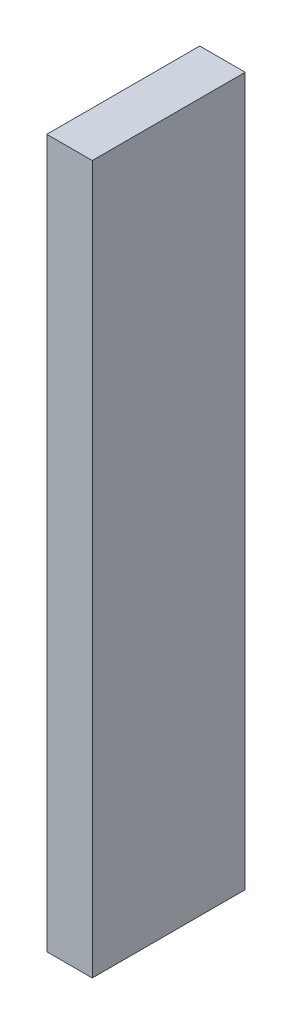
ISO-10303-21;
HEADER;
FILE_DESCRIPTION(('STEP AP214'),'2;1');
FILE_NAME('part.step','',(''),(''),'','','');
FILE_SCHEMA(('AUTOMOTIVE_DESIGN { 1 0 10303 214 1 1 1 1 }'));
ENDSEC;
DATA;
#1=APPLICATION_CONTEXT('core data for automotive mechanical design processes');
#2=APPLICATION_PROTOCOL_DEFINITION('international standard','automotive_design',2000,#1);
#3=PRODUCT_CONTEXT('',#1,'mechanical');
#4=PRODUCT('Part','Part','',(#3));
#5=PRODUCT_RELATED_PRODUCT_CATEGORY('part','',(#4));
#6=PRODUCT_DEFINITION_FORMATION('','',#4);
#7=PRODUCT_DEFINITION_CONTEXT('part definition',#1,'design');
#8=PRODUCT_DEFINITION('design','',#6,#7);
#9=PRODUCT_DEFINITION_SHAPE('','',#8);
#10=(LENGTH_UNIT() NAMED_UNIT(*) SI_UNIT(.MILLI.,.METRE.));
#11=(NAMED_UNIT(*) PLANE_ANGLE_UNIT() SI_UNIT($,.RADIAN.));
#12=(NAMED_UNIT(*) SI_UNIT($,.STERADIAN.) SOLID_ANGLE_UNIT());
#13=UNCERTAINTY_MEASURE_WITH_UNIT(LENGTH_MEASURE(1.E-05),#10,'distance_accuracy_value','');
#14=(GEOMETRIC_REPRESENTATION_CONTEXT(3) GLOBAL_UNCERTAINTY_ASSIGNED_CONTEXT((#13)) GLOBAL_UNIT_ASSIGNED_CONTEXT((#10,
#11,#12)) REPRESENTATION_CONTEXT('',''));
#15=CARTESIAN_POINT('',(0.,0.,0.));
#16=DIRECTION('',(0.,0.,1.));
#17=DIRECTION('',(1.,0.,0.));
#18=AXIS2_PLACEMENT_3D('',#15,#16,#17);
#19=CARTESIAN_POINT('',(130.275545144781,22.4180708263693,126.072028202897));
#20=DIRECTION('',(-1.69244514382854E-09,0.,1.));
#21=DIRECTION('',(1.,0.,1.69244514382854E-09));
#22=AXIS2_PLACEMENT_3D('',#19,#20,#21);
#23=PLANE('',#22);
#24=DIRECTION('',(0.,-1.,0.));
#25=VECTOR('',#24,1.);
#26=CARTESIAN_POINT('',(131.258630241794,22.4180708263693,126.072028204561));
#27=LINE('',#26,#25);
#28=CARTESIAN_POINT('',(131.258630241794,22.4180708263693,126.072028204561));
#29=VERTEX_POINT('',#28);
#30=CARTESIAN_POINT('',(131.258630241794,7.11212965552235,126.072028204561));
#31=VERTEX_POINT('',#30);
#32=EDGE_CURVE('E79',#29,#31,#27,.T.);
#33=ORIENTED_EDGE('',*,*,#32,.F.);
#34=DIRECTION('',(1.,0.,1.69244514382854E-09));
#35=VECTOR('',#34,1.);
#36=CARTESIAN_POINT('',(130.275545144781,22.4180708263693,126.072028202897));
#37=LINE('',#36,#35);
#38=CARTESIAN_POINT('',(130.275545144781,22.4180708263693,126.072028202897));
#39=VERTEX_POINT('',#38);
#40=EDGE_CURVE('E32',#39,#29,#37,.T.);
#41=ORIENTED_EDGE('',*,*,#40,.F.);
#42=DIRECTION('',(0.,-1.,0.));
#43=VECTOR('',#42,1.);
#44=CARTESIAN_POINT('',(130.275545144781,22.4180708263693,126.072028202897));
#45=LINE('',#44,#43);
#46=CARTESIAN_POINT('',(130.275545144781,7.11212965552235,126.072028202897));
#47=VERTEX_POINT('',#46);
#48=EDGE_CURVE('E71',#39,#47,#45,.T.);
#49=ORIENTED_EDGE('',*,*,#48,.T.);
#50=DIRECTION('',(1.,0.,1.69244514382854E-09));
#51=VECTOR('',#50,1.);
#52=CARTESIAN_POINT('',(130.275545144781,7.11212965552235,126.072028202897));
#53=LINE('',#52,#51);
#54=EDGE_CURVE('E10',#47,#31,#53,.T.);
#55=ORIENTED_EDGE('',*,*,#54,.T.);
#56=EDGE_LOOP('',(#33,#41,#49,#55));
#57=FACE_BOUND('',#56,.T.);
#58=ADVANCED_FACE('F16',(#57),#23,.T.);
#59=CARTESIAN_POINT('',(130.275545144781,7.11212965552235,126.072028202897));
#60=DIRECTION('',(0.,-1.,0.));
#61=DIRECTION('',(0.,0.,-1.));
#62=AXIS2_PLACEMENT_3D('',#59,#60,#61);
#63=PLANE('',#62);
#64=DIRECTION('',(1.69244514382854E-09,0.,-1.));
#65=VECTOR('',#64,1.);
#66=CARTESIAN_POINT('',(131.258630241794,7.11212965552235,126.072028204561));
#67=LINE('',#66,#65);
#68=CARTESIAN_POINT('',(131.258630247389,7.11212965552235,122.766087033712));
#69=VERTEX_POINT('',#68);
#70=EDGE_CURVE('E82',#31,#69,#67,.T.);
#71=ORIENTED_EDGE('',*,*,#70,.F.);
#72=ORIENTED_EDGE('',*,*,#54,.F.);
#73=DIRECTION('',(1.69244514382854E-09,0.,-1.));
#74=VECTOR('',#73,1.);
#75=CARTESIAN_POINT('',(130.275545144781,7.11212965552235,126.072028202897));
#76=LINE('',#75,#74);
#77=CARTESIAN_POINT('',(130.275545150376,7.11212965552235,122.766087032048));
#78=VERTEX_POINT('',#77);
#79=EDGE_CURVE('E67',#47,#78,#76,.T.);
#80=ORIENTED_EDGE('',*,*,#79,.T.);
#81=DIRECTION('',(1.,0.,1.69244514382854E-09));
#82=VECTOR('',#81,1.);
#83=CARTESIAN_POINT('',(130.275545150376,7.11212965552235,122.766087032048));
#84=LINE('',#83,#82);
#85=EDGE_CURVE('E24',#78,#69,#84,.T.);
#86=ORIENTED_EDGE('',*,*,#85,.T.);
#87=EDGE_LOOP('',(#71,#72,#80,#86));
#88=FACE_BOUND('',#87,.T.);
#89=ADVANCED_FACE('F68',(#88),#63,.T.);
#90=CARTESIAN_POINT('',(130.275545150376,7.11212965552235,122.766087032048));
#91=DIRECTION('',(1.69244514382854E-09,0.,-1.));
#92=DIRECTION('',(-1.,0.,-1.69244514382854E-09));
#93=AXIS2_PLACEMENT_3D('',#90,#91,#92);
#94=PLANE('',#93);
#95=DIRECTION('',(0.,1.,0.));
#96=VECTOR('',#95,1.);
#97=CARTESIAN_POINT('',(131.258630247389,7.11212965552235,122.766087033712));
#98=LINE('',#97,#96);
#99=CARTESIAN_POINT('',(131.258630247389,22.418070826371,122.766087025251));
#100=VERTEX_POINT('',#99);
#101=EDGE_CURVE('E65',#69,#100,#98,.T.);
#102=ORIENTED_EDGE('',*,*,#101,.F.);
#103=ORIENTED_EDGE('',*,*,#85,.F.);
#104=DIRECTION('',(0.,1.,0.));
#105=VECTOR('',#104,1.);
#106=CARTESIAN_POINT('',(130.275545150376,7.11212965552235,122.766087032048));
#107=LINE('',#106,#105);
#108=CARTESIAN_POINT('',(130.275545150376,22.418070826371,122.766087023588));
#109=VERTEX_POINT('',#108);
#110=EDGE_CURVE('E62',#78,#109,#107,.T.);
#111=ORIENTED_EDGE('',*,*,#110,.T.);
#112=DIRECTION('',(1.,0.,1.69244514382854E-09));
#113=VECTOR('',#112,1.);
#114=CARTESIAN_POINT('',(130.275545150376,22.418070826371,122.766087023588));
#115=LINE('',#114,#113);
#116=EDGE_CURVE('E48',#109,#100,#115,.T.);
#117=ORIENTED_EDGE('',*,*,#116,.T.);
#118=EDGE_LOOP('',(#102,#103,#111,#117));
#119=FACE_BOUND('',#118,.T.);
#120=ADVANCED_FACE('F60',(#119),#94,.T.);
#121=CARTESIAN_POINT('',(130.275545150376,22.418070826371,122.766087023588));
#122=DIRECTION('',(0.,1.,0.));
#123=DIRECTION('',(-1.,0.,0.));
#124=AXIS2_PLACEMENT_3D('',#121,#122,#123);
#125=PLANE('',#124);
#126=DIRECTION('',(-1.69244514382854E-09,0.,1.));
#127=VECTOR('',#126,1.);
#128=CARTESIAN_POINT('',(131.258630247389,22.418070826371,122.766087025251));
#129=LINE('',#128,#127);
#130=EDGE_CURVE('E85',#100,#29,#129,.T.);
#131=ORIENTED_EDGE('',*,*,#130,.F.);
#132=ORIENTED_EDGE('',*,*,#116,.F.);
#133=DIRECTION('',(-1.69244514382854E-09,0.,1.));
#134=VECTOR('',#133,1.);
#135=CARTESIAN_POINT('',(130.275545150376,22.418070826371,122.766087023588));
#136=LINE('',#135,#134);
#137=EDGE_CURVE('E74',#109,#39,#136,.T.);
#138=ORIENTED_EDGE('',*,*,#137,.T.);
#139=ORIENTED_EDGE('',*,*,#40,.T.);
#140=EDGE_LOOP('',(#131,#132,#138,#139));
#141=FACE_BOUND('',#140,.T.);
#142=ADVANCED_FACE('F96',(#141),#125,.T.);
#143=CARTESIAN_POINT('',(130.275545201028,17.2651002409467,92.8378644340291));
#144=DIRECTION('',(1.,0.,1.69244514382854E-09));
#145=DIRECTION('',(0.,1.,0.));
#146=AXIS2_PLACEMENT_3D('',#143,#144,#145);
#147=PLANE('',#146);
#148=ORIENTED_EDGE('',*,*,#48,.F.);
#149=ORIENTED_EDGE('',*,*,#137,.F.);
#150=ORIENTED_EDGE('',*,*,#110,.F.);
#151=ORIENTED_EDGE('',*,*,#79,.F.);
#152=EDGE_LOOP('',(#148,#149,#150,#151));
#153=FACE_BOUND('',#152,.T.);
#154=ADVANCED_FACE('F73',(#153),#147,.F.);
#155=CARTESIAN_POINT('',(131.258630298041,17.2651002409467,92.8378644356929));
#156=DIRECTION('',(1.,0.,1.69244514382854E-09));
#157=DIRECTION('',(0.,1.,0.));
#158=AXIS2_PLACEMENT_3D('',#155,#156,#157);
#159=PLANE('',#158);
#160=ORIENTED_EDGE('',*,*,#32,.T.);
#161=ORIENTED_EDGE('',*,*,#70,.T.);
#162=ORIENTED_EDGE('',*,*,#101,.T.);
#163=ORIENTED_EDGE('',*,*,#130,.T.);
#164=EDGE_LOOP('',(#160,#161,#162,#163));
#165=FACE_BOUND('',#164,.T.);
#166=ADVANCED_FACE('F89',(#165),#159,.T.);
#167=CLOSED_SHELL('',(#58,#89,#120,#142,#154,#166));
#168=MANIFOLD_SOLID_BREP('B1',#167);
#169=ADVANCED_BREP_SHAPE_REPRESENTATION('',(#18,#168),#14);
#170=SHAPE_DEFINITION_REPRESENTATION(#9,#169);
ENDSEC;
END-ISO-10303-21;
